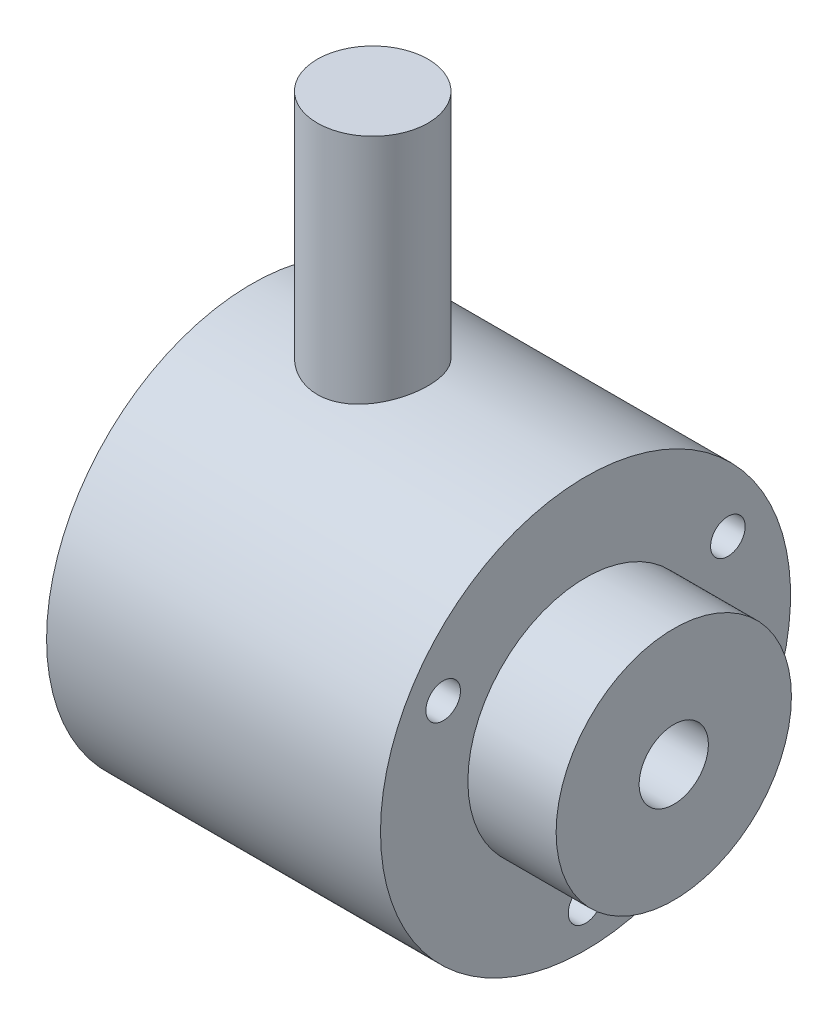
ISO-10303-21;
HEADER;
FILE_DESCRIPTION(('STEP AP214'),'2;1');
FILE_NAME('part.step','',(''),(''),'','','');
FILE_SCHEMA(('AUTOMOTIVE_DESIGN { 1 0 10303 214 1 1 1 1 }'));
ENDSEC;
DATA;
#1=APPLICATION_CONTEXT('core data for automotive mechanical design processes');
#2=APPLICATION_PROTOCOL_DEFINITION('international standard','automotive_design',2000,#1);
#3=PRODUCT_CONTEXT('',#1,'mechanical');
#4=PRODUCT('Part','Part','',(#3));
#5=PRODUCT_RELATED_PRODUCT_CATEGORY('part','',(#4));
#6=PRODUCT_DEFINITION_FORMATION('','',#4);
#7=PRODUCT_DEFINITION_CONTEXT('part definition',#1,'design');
#8=PRODUCT_DEFINITION('design','',#6,#7);
#9=PRODUCT_DEFINITION_SHAPE('','',#8);
#10=(LENGTH_UNIT() NAMED_UNIT(*) SI_UNIT(.MILLI.,.METRE.));
#11=(NAMED_UNIT(*) PLANE_ANGLE_UNIT() SI_UNIT($,.RADIAN.));
#12=(NAMED_UNIT(*) SI_UNIT($,.STERADIAN.) SOLID_ANGLE_UNIT());
#13=UNCERTAINTY_MEASURE_WITH_UNIT(LENGTH_MEASURE(1.E-05),#10,'distance_accuracy_value','');
#14=(GEOMETRIC_REPRESENTATION_CONTEXT(3) GLOBAL_UNCERTAINTY_ASSIGNED_CONTEXT((#13)) GLOBAL_UNIT_ASSIGNED_CONTEXT((#10,
#11,#12)) REPRESENTATION_CONTEXT('',''));
#15=CARTESIAN_POINT('',(0.,0.,0.));
#16=DIRECTION('',(0.,0.,1.));
#17=DIRECTION('',(1.,0.,0.));
#18=AXIS2_PLACEMENT_3D('',#15,#16,#17);
#19=CARTESIAN_POINT('',(0.,0.,0.));
#20=DIRECTION('',(-1.,0.,0.));
#21=DIRECTION('',(0.,0.,1.));
#22=AXIS2_PLACEMENT_3D('',#19,#20,#21);
#23=CYLINDRICAL_SURFACE('',#22,11.85);
#24=CARTESIAN_POINT('',(0.,0.,0.));
#25=DIRECTION('',(-1.,0.,0.));
#26=DIRECTION('',(0.,0.,1.));
#27=AXIS2_PLACEMENT_3D('',#24,#25,#26);
#28=CIRCLE('',#27,11.85);
#29=CARTESIAN_POINT('',(0.,0.,11.85));
#30=VERTEX_POINT('',#29);
#31=EDGE_CURVE('E54',#30,#30,#28,.T.);
#32=ORIENTED_EDGE('',*,*,#31,.F.);
#33=EDGE_LOOP('',(#32));
#34=FACE_BOUND('',#33,.T.);
#35=CARTESIAN_POINT('',(19.3,0.,0.));
#36=DIRECTION('',(-1.,0.,0.));
#37=DIRECTION('',(0.,0.,1.));
#38=AXIS2_PLACEMENT_3D('',#35,#36,#37);
#39=CIRCLE('',#38,11.85);
#40=CARTESIAN_POINT('',(19.3,0.,11.85));
#41=VERTEX_POINT('',#40);
#42=EDGE_CURVE('E49',#41,#41,#39,.T.);
#43=ORIENTED_EDGE('',*,*,#42,.T.);
#44=EDGE_LOOP('',(#43));
#45=FACE_BOUND('',#44,.T.);
#46=CARTESIAN_POINT('',(7.,11.409754598588,-3.2));
#47=CARTESIAN_POINT('',(6.82380774229045,11.4097575680034,-3.19999592401129));
#48=CARTESIAN_POINT('',(6.64757271287549,11.4138804270188,-3.18539868863309));
#49=CARTESIAN_POINT('',(6.30019838440241,11.4298755165217,-3.12750986156378));
#50=CARTESIAN_POINT('',(6.12906159932202,11.4417515060929,-3.08420435058802));
#51=CARTESIAN_POINT('',(5.79695939713014,11.471811921207,-2.97043115845945));
#52=CARTESIAN_POINT('',(5.6359798117785,11.4899873189946,-2.90000233207576));
#53=CARTESIAN_POINT('',(5.32809447371995,11.5305870644057,-2.73410407961744));
#54=CARTESIAN_POINT('',(5.18118991747341,11.553011772764,-2.6386325273374));
#55=CARTESIAN_POINT('',(4.90185693204531,11.6002279726611,-2.42274023706277));
#56=CARTESIAN_POINT('',(4.7698429474427,11.6250622743117,-2.30179251904075));
#57=CARTESIAN_POINT('',(4.52770486938859,11.6739303333733,-2.03951413517226));
#58=CARTESIAN_POINT('',(4.41758309435205,11.6979640057724,-1.89818131324726));
#59=CARTESIAN_POINT('',(4.22062031965671,11.7430014030105,-1.59626366210396));
#60=CARTESIAN_POINT('',(4.13419236113306,11.7639487428485,-1.4354002341465));
#61=CARTESIAN_POINT('',(3.98976602327142,11.799961482024,-1.10076516604323));
#62=CARTESIAN_POINT('',(3.93176272315162,11.8150278993552,-0.92699576613845));
#63=CARTESIAN_POINT('',(3.84717643084845,11.8372784899246,-0.575808395145115));
#64=CARTESIAN_POINT('',(3.81988819948586,11.8446392990129,-0.398571674602367));
#65=CARTESIAN_POINT('',(3.79528677210897,11.8512673231678,-0.0418932622875973));
#66=CARTESIAN_POINT('',(3.79796843625129,11.8505359260496,0.137548046124414));
#67=CARTESIAN_POINT('',(3.83273627728727,11.8411909294001,0.488629489641201));
#68=CARTESIAN_POINT('',(3.86406034273173,11.8327816305976,0.660351367713395));
#69=CARTESIAN_POINT('',(3.9539912779912,11.8092674719823,0.996004341884338));
#70=CARTESIAN_POINT('',(4.01259972310905,11.7941622255717,1.15993498754273));
#71=CARTESIAN_POINT('',(4.15601315484096,11.7586523764224,1.47728465005468));
#72=CARTESIAN_POINT('',(4.24107716741304,11.7381957073039,1.63058054498369));
#73=CARTESIAN_POINT('',(4.4347877291809,11.6941839117502,1.92098043659776));
#74=CARTESIAN_POINT('',(4.54343897597417,11.6706281684767,2.05808119947439));
#75=CARTESIAN_POINT('',(4.78527675183331,11.6220935512996,2.31674828240857));
#76=CARTESIAN_POINT('',(4.9191276338429,11.5970932195982,2.43769018428542));
#77=CARTESIAN_POINT('',(5.20546913518976,11.5491537810121,2.65556513991868));
#78=CARTESIAN_POINT('',(5.3579609507412,11.5262148065715,2.75249665168634));
#79=CARTESIAN_POINT('',(5.67863713907115,11.4849075132602,2.92009097160132));
#80=CARTESIAN_POINT('',(5.84691656566427,11.4665696935773,2.99057995132467));
#81=CARTESIAN_POINT('',(6.19355733166552,11.4369178687564,3.10205966238327));
#82=CARTESIAN_POINT('',(6.37191608482666,11.425602070691,3.14305792398657));
#83=CARTESIAN_POINT('',(6.72780273686184,11.411658614057,3.19330733896917));
#84=CARTESIAN_POINT('',(6.90518901880268,11.408775667861,3.20349166060649));
#85=CARTESIAN_POINT('',(7.25913077717547,11.411325142468,3.19439853899469));
#86=CARTESIAN_POINT('',(7.4356863424694,11.4167566526082,3.17512432227043));
#87=CARTESIAN_POINT('',(7.77933151479855,11.4350760579743,3.10848478303929));
#88=CARTESIAN_POINT('',(7.94653941442026,11.4478139280258,3.06168419628569));
#89=CARTESIAN_POINT('',(8.27073121655569,11.4791633930181,2.9419572780013));
#90=CARTESIAN_POINT('',(8.42771375565732,11.4977757693178,2.86902747088893));
#91=CARTESIAN_POINT('',(8.73089240857395,11.5392982716577,2.69722999475763));
#92=CARTESIAN_POINT('',(8.87676697287682,11.562295554802,2.59781642857554));
#93=CARTESIAN_POINT('',(9.15010593726874,11.609793376176,2.37654730660019));
#94=CARTESIAN_POINT('',(9.27756677667512,11.6342942038462,2.2546874206737));
#95=CARTESIAN_POINT('',(9.51435369753933,11.6829202250697,1.98766156974679));
#96=CARTESIAN_POINT('',(9.62302795520987,11.7070125941024,1.84191041226666));
#97=CARTESIAN_POINT('',(9.81436959196133,11.7513610088361,1.53369440981604));
#98=CARTESIAN_POINT('',(9.89703835570024,11.7716172587678,1.37123045532696));
#99=CARTESIAN_POINT('',(10.0332567737972,11.8058804960917,1.03534423344111));
#100=CARTESIAN_POINT('',(10.0870248347323,11.8199342079645,0.862015538298308));
#101=CARTESIAN_POINT('',(10.164543800741,11.8404146993941,0.508345583337205));
#102=CARTESIAN_POINT('',(10.18830154049,11.8468432155245,0.328005929870998));
#103=CARTESIAN_POINT('',(10.2046882508709,11.8512646812601,-0.0284838875317339));
#104=CARTESIAN_POINT('',(10.1982722253888,11.8495164362624,-0.204587556452675));
#105=CARTESIAN_POINT('',(10.1567172698764,11.8383684732355,-0.553111932300254));
#106=CARTESIAN_POINT('',(10.1215794676829,11.82896905565,-0.725532783569712));
#107=CARTESIAN_POINT('',(10.0241238347795,11.8036285308137,-1.06061737179052));
#108=CARTESIAN_POINT('',(9.96200413452976,11.7877351587624,-1.22334258256347));
#109=CARTESIAN_POINT('',(9.81252467956184,11.751066489492,-1.53615320081743));
#110=CARTESIAN_POINT('',(9.72516131635676,11.7302904943997,-1.68623679726302));
#111=CARTESIAN_POINT('',(9.52490396376074,11.6853704991508,-1.97393214636261));
#112=CARTESIAN_POINT('',(9.41137997102649,11.6611502380674,-2.11109342317194));
#113=CARTESIAN_POINT('',(9.16321284847764,11.6123733344245,-2.36474175477149));
#114=CARTESIAN_POINT('',(9.02856412246683,11.587816604308,-2.48122331377616));
#115=CARTESIAN_POINT('',(8.73829103098257,11.5405034566917,-2.69282910032353));
#116=CARTESIAN_POINT('',(8.58225970993745,11.5178005977344,-2.78740815092461));
#117=CARTESIAN_POINT('',(8.25591651396196,11.4775303232658,-2.94885855927283));
#118=CARTESIAN_POINT('',(8.0856138363468,11.4599596325385,-3.0157475994878));
#119=CARTESIAN_POINT('',(7.76334508913284,11.4343169514178,-3.11141954576664));
#120=CARTESIAN_POINT('',(7.61274290482724,11.4251817322584,-3.14455799961762));
#121=CARTESIAN_POINT('',(7.30810443709434,11.4128996193869,-3.18884868038529));
#122=CARTESIAN_POINT('',(7.15406857092972,11.409752002029,-3.20000356418474));
#123=CARTESIAN_POINT('',(7.,11.409754598588,-3.2));
#124=B_SPLINE_CURVE_WITH_KNOTS('',3,(#46,#47,#48,#49,#50,#51,#52,#53,#54,#55,#56,#57,#58,#59,
#60,#61,#62,#63,#64,#65,#66,#67,#68,#69,#70,#71,#72,#73,#74,#75,#76,#77,#78,#79,#80,#81,#82,#83,
#84,#85,#86,#87,#88,#89,#90,#91,#92,#93,#94,#95,#96,#97,#98,#99,#100,#101,#102,#103,#104,#105,
#106,#107,#108,#109,#110,#111,#112,#113,#114,#115,#116,#117,#118,#119,#120,#121,#122,#123),
.UNSPECIFIED.,.T.,.F.,(4,2,2,2,2,2,2,2,2,2,2,2,2,2,2,2,2,2,2,2,2,2,2,2,2,2,2,2,2,2,2,2,2,2,2,2,
2,2,4),(0.,0.528010074198887,1.05627634292522,1.58378865627004,2.1113457715579,2.6511305284997,
3.19097241896999,3.73970018929446,4.28833293211483,4.82409394550201,5.35976307717268,
5.8815813025168,6.40342965952268,6.93055743822454,7.45779029535627,8.00161015244497,
8.54546492553488,9.09283472939428,9.64006471617913,10.1705476708594,10.7009725271451,
11.2208770374876,11.7408507286849,12.2725058361726,12.8042636131897,13.3518309263622,
13.8993690794717,14.442709063442,14.9859252825824,15.5120664629658,16.0381869840109,
16.5605077942108,17.0829033051786,17.6195131338783,18.156265357767,18.7052087809869,
19.2538011135512,19.7155670966802,20.1772772684314),.UNSPECIFIED.);
#125=CARTESIAN_POINT('',(7.,11.409754598588,-3.2));
#126=VERTEX_POINT('',#125);
#127=EDGE_CURVE('E10',#126,#126,#124,.T.);
#128=ORIENTED_EDGE('',*,*,#127,.F.);
#129=EDGE_LOOP('',(#128));
#130=FACE_BOUND('',#129,.T.);
#131=ADVANCED_FACE('F30',(#34,#45,#130),#23,.T.);
#132=CARTESIAN_POINT('',(0.,11.85,0.));
#133=DIRECTION('',(1.,0.,0.));
#134=DIRECTION('',(0.,0.,-1.));
#135=AXIS2_PLACEMENT_3D('',#132,#133,#134);
#136=PLANE('',#135);
#137=ORIENTED_EDGE('',*,*,#31,.T.);
#138=EDGE_LOOP('',(#137));
#139=FACE_BOUND('',#138,.T.);
#140=ADVANCED_FACE('F32',(#139),#136,.F.);
#141=CARTESIAN_POINT('',(24.4,0.,0.));
#142=DIRECTION('',(-1.,0.,0.));
#143=DIRECTION('',(0.,0.,1.));
#144=AXIS2_PLACEMENT_3D('',#141,#142,#143);
#145=PLANE('',#144);
#146=CARTESIAN_POINT('',(24.4,0.,0.));
#147=DIRECTION('',(1.,0.,0.));
#148=DIRECTION('',(0.,0.,-1.));
#149=AXIS2_PLACEMENT_3D('',#146,#147,#148);
#150=CIRCLE('',#149,2.);
#151=CARTESIAN_POINT('',(24.4,0.,-2.));
#152=VERTEX_POINT('',#151);
#153=EDGE_CURVE('E61',#152,#152,#150,.T.);
#154=ORIENTED_EDGE('',*,*,#153,.F.);
#155=EDGE_LOOP('',(#154));
#156=FACE_BOUND('',#155,.T.);
#157=CARTESIAN_POINT('',(24.4,0.,0.));
#158=DIRECTION('',(-1.,0.,0.));
#159=DIRECTION('',(0.,0.,1.));
#160=AXIS2_PLACEMENT_3D('',#157,#158,#159);
#161=CIRCLE('',#160,6.8);
#162=CARTESIAN_POINT('',(24.4,0.,6.8));
#163=VERTEX_POINT('',#162);
#164=EDGE_CURVE('E41',#163,#163,#161,.T.);
#165=ORIENTED_EDGE('',*,*,#164,.F.);
#166=EDGE_LOOP('',(#165));
#167=FACE_BOUND('',#166,.T.);
#168=ADVANCED_FACE('F109',(#156,#167),#145,.F.);
#169=CARTESIAN_POINT('',(0.,0.,0.));
#170=DIRECTION('',(-1.,0.,0.));
#171=DIRECTION('',(0.,0.,1.));
#172=AXIS2_PLACEMENT_3D('',#169,#170,#171);
#173=CYLINDRICAL_SURFACE('',#172,6.8);
#174=CARTESIAN_POINT('',(19.3,0.,0.));
#175=DIRECTION('',(-1.,0.,0.));
#176=DIRECTION('',(0.,0.,1.));
#177=AXIS2_PLACEMENT_3D('',#174,#175,#176);
#178=CIRCLE('',#177,6.8);
#179=CARTESIAN_POINT('',(19.3,0.,6.8));
#180=VERTEX_POINT('',#179);
#181=EDGE_CURVE('E45',#180,#180,#178,.T.);
#182=ORIENTED_EDGE('',*,*,#181,.F.);
#183=EDGE_LOOP('',(#182));
#184=FACE_BOUND('',#183,.T.);
#185=ORIENTED_EDGE('',*,*,#164,.T.);
#186=EDGE_LOOP('',(#185));
#187=FACE_BOUND('',#186,.T.);
#188=ADVANCED_FACE('F98',(#184,#187),#173,.T.);
#189=CARTESIAN_POINT('',(19.3,6.8,0.));
#190=DIRECTION('',(-1.,0.,0.));
#191=DIRECTION('',(0.,0.,1.));
#192=AXIS2_PLACEMENT_3D('',#189,#190,#191);
#193=PLANE('',#192);
#194=CARTESIAN_POINT('',(19.3,4.75000000000003,-8.22724133595227));
#195=DIRECTION('',(1.,0.,0.));
#196=DIRECTION('',(0.,0.,-1.));
#197=AXIS2_PLACEMENT_3D('',#194,#195,#196);
#198=CIRCLE('',#197,1.);
#199=CARTESIAN_POINT('',(19.3,4.75000000000003,-9.22724133595227));
#200=VERTEX_POINT('',#199);
#201=EDGE_CURVE('E79',#200,#200,#198,.T.);
#202=ORIENTED_EDGE('',*,*,#201,.F.);
#203=EDGE_LOOP('',(#202));
#204=FACE_BOUND('',#203,.T.);
#205=CARTESIAN_POINT('',(19.3,4.75000000000003,8.22724133595215));
#206=DIRECTION('',(1.,0.,0.));
#207=DIRECTION('',(0.,0.,-1.));
#208=AXIS2_PLACEMENT_3D('',#205,#206,#207);
#209=CIRCLE('',#208,1.);
#210=CARTESIAN_POINT('',(19.3,4.75000000000003,7.22724133595215));
#211=VERTEX_POINT('',#210);
#212=EDGE_CURVE('E73',#211,#211,#209,.T.);
#213=ORIENTED_EDGE('',*,*,#212,.F.);
#214=EDGE_LOOP('',(#213));
#215=FACE_BOUND('',#214,.T.);
#216=CARTESIAN_POINT('',(19.3,-9.5,0.));
#217=DIRECTION('',(1.,0.,0.));
#218=DIRECTION('',(0.,0.,-1.));
#219=AXIS2_PLACEMENT_3D('',#216,#217,#218);
#220=CIRCLE('',#219,1.);
#221=CARTESIAN_POINT('',(19.3,-9.5,-1.));
#222=VERTEX_POINT('',#221);
#223=EDGE_CURVE('E67',#222,#222,#220,.T.);
#224=ORIENTED_EDGE('',*,*,#223,.F.);
#225=EDGE_LOOP('',(#224));
#226=FACE_BOUND('',#225,.T.);
#227=ORIENTED_EDGE('',*,*,#42,.F.);
#228=EDGE_LOOP('',(#227));
#229=FACE_BOUND('',#228,.T.);
#230=ORIENTED_EDGE('',*,*,#181,.T.);
#231=EDGE_LOOP('',(#230));
#232=FACE_BOUND('',#231,.T.);
#233=ADVANCED_FACE('F94',(#204,#215,#226,#229,#232),#193,.F.);
#234=CARTESIAN_POINT('',(7.,25.,0.));
#235=DIRECTION('',(0.,-1.,0.));
#236=DIRECTION('',(0.,0.,-1.));
#237=AXIS2_PLACEMENT_3D('',#234,#235,#236);
#238=CYLINDRICAL_SURFACE('',#237,3.2);
#239=CARTESIAN_POINT('',(7.,25.,0.));
#240=DIRECTION('',(0.,1.,0.));
#241=DIRECTION('',(0.,0.,1.));
#242=AXIS2_PLACEMENT_3D('',#239,#240,#241);
#243=CIRCLE('',#242,3.2);
#244=CARTESIAN_POINT('',(7.,25.,3.2));
#245=VERTEX_POINT('',#244);
#246=EDGE_CURVE('E57',#245,#245,#243,.T.);
#247=ORIENTED_EDGE('',*,*,#246,.F.);
#248=EDGE_LOOP('',(#247));
#249=FACE_BOUND('',#248,.T.);
#250=ORIENTED_EDGE('',*,*,#127,.T.);
#251=EDGE_LOOP('',(#250));
#252=FACE_BOUND('',#251,.T.);
#253=ADVANCED_FACE('F97',(#249,#252),#238,.T.);
#254=CARTESIAN_POINT('',(7.,25.,0.));
#255=DIRECTION('',(0.,1.,0.));
#256=DIRECTION('',(0.,0.,1.));
#257=AXIS2_PLACEMENT_3D('',#254,#255,#256);
#258=PLANE('',#257);
#259=ORIENTED_EDGE('',*,*,#246,.T.);
#260=EDGE_LOOP('',(#259));
#261=FACE_BOUND('',#260,.T.);
#262=ADVANCED_FACE('F127',(#261),#258,.T.);
#263=CARTESIAN_POINT('',(10.4,0.,0.));
#264=DIRECTION('',(1.,0.,0.));
#265=DIRECTION('',(0.,0.,-1.));
#266=AXIS2_PLACEMENT_3D('',#263,#264,#265);
#267=CYLINDRICAL_SURFACE('',#266,2.);
#268=CARTESIAN_POINT('',(10.4,0.,0.));
#269=DIRECTION('',(1.,0.,0.));
#270=DIRECTION('',(0.,0.,-1.));
#271=AXIS2_PLACEMENT_3D('',#268,#269,#270);
#272=CIRCLE('',#271,2.);
#273=CARTESIAN_POINT('',(10.4,0.,-2.));
#274=VERTEX_POINT('',#273);
#275=EDGE_CURVE('E60',#274,#274,#272,.T.);
#276=ORIENTED_EDGE('',*,*,#275,.F.);
#277=EDGE_LOOP('',(#276));
#278=FACE_BOUND('',#277,.T.);
#279=ORIENTED_EDGE('',*,*,#153,.T.);
#280=EDGE_LOOP('',(#279));
#281=FACE_BOUND('',#280,.T.);
#282=ADVANCED_FACE('F131',(#278,#281),#267,.F.);
#283=CARTESIAN_POINT('',(10.4,0.,0.));
#284=DIRECTION('',(1.,0.,0.));
#285=DIRECTION('',(0.,0.,-1.));
#286=AXIS2_PLACEMENT_3D('',#283,#284,#285);
#287=PLANE('',#286);
#288=ORIENTED_EDGE('',*,*,#275,.T.);
#289=EDGE_LOOP('',(#288));
#290=FACE_BOUND('',#289,.T.);
#291=ADVANCED_FACE('F135',(#290),#287,.T.);
#292=CARTESIAN_POINT('',(15.3,-9.5,0.));
#293=DIRECTION('',(1.,0.,0.));
#294=DIRECTION('',(0.,0.,-1.));
#295=AXIS2_PLACEMENT_3D('',#292,#293,#294);
#296=CYLINDRICAL_SURFACE('',#295,1.);
#297=CARTESIAN_POINT('',(15.3,-9.5,0.));
#298=DIRECTION('',(1.,0.,0.));
#299=DIRECTION('',(0.,0.,-1.));
#300=AXIS2_PLACEMENT_3D('',#297,#298,#299);
#301=CIRCLE('',#300,1.);
#302=CARTESIAN_POINT('',(15.3,-9.5,-1.));
#303=VERTEX_POINT('',#302);
#304=EDGE_CURVE('E64',#303,#303,#301,.T.);
#305=ORIENTED_EDGE('',*,*,#304,.F.);
#306=EDGE_LOOP('',(#305));
#307=FACE_BOUND('',#306,.T.);
#308=ORIENTED_EDGE('',*,*,#223,.T.);
#309=EDGE_LOOP('',(#308));
#310=FACE_BOUND('',#309,.T.);
#311=ADVANCED_FACE('F139',(#307,#310),#296,.F.);
#312=CARTESIAN_POINT('',(15.3,-9.5,0.));
#313=DIRECTION('',(1.,0.,0.));
#314=DIRECTION('',(0.,0.,-1.));
#315=AXIS2_PLACEMENT_3D('',#312,#313,#314);
#316=PLANE('',#315);
#317=ORIENTED_EDGE('',*,*,#304,.T.);
#318=EDGE_LOOP('',(#317));
#319=FACE_BOUND('',#318,.T.);
#320=ADVANCED_FACE('F143',(#319),#316,.T.);
#321=CARTESIAN_POINT('',(15.3,4.75000000000003,8.22724133595215));
#322=DIRECTION('',(1.,0.,0.));
#323=DIRECTION('',(0.,0.,-1.));
#324=AXIS2_PLACEMENT_3D('',#321,#322,#323);
#325=CYLINDRICAL_SURFACE('',#324,1.);
#326=CARTESIAN_POINT('',(15.3,4.75000000000003,8.22724133595215));
#327=DIRECTION('',(1.,0.,0.));
#328=DIRECTION('',(0.,0.,-1.));
#329=AXIS2_PLACEMENT_3D('',#326,#327,#328);
#330=CIRCLE('',#329,1.);
#331=CARTESIAN_POINT('',(15.3,4.75000000000003,7.22724133595215));
#332=VERTEX_POINT('',#331);
#333=EDGE_CURVE('E70',#332,#332,#330,.T.);
#334=ORIENTED_EDGE('',*,*,#333,.F.);
#335=EDGE_LOOP('',(#334));
#336=FACE_BOUND('',#335,.T.);
#337=ORIENTED_EDGE('',*,*,#212,.T.);
#338=EDGE_LOOP('',(#337));
#339=FACE_BOUND('',#338,.T.);
#340=ADVANCED_FACE('F147',(#336,#339),#325,.F.);
#341=CARTESIAN_POINT('',(15.3,4.75000000000003,8.22724133595215));
#342=DIRECTION('',(1.,0.,0.));
#343=DIRECTION('',(0.,0.,-1.));
#344=AXIS2_PLACEMENT_3D('',#341,#342,#343);
#345=PLANE('',#344);
#346=ORIENTED_EDGE('',*,*,#333,.T.);
#347=EDGE_LOOP('',(#346));
#348=FACE_BOUND('',#347,.T.);
#349=ADVANCED_FACE('F90',(#348),#345,.T.);
#350=CARTESIAN_POINT('',(15.3,4.75000000000003,-8.22724133595227));
#351=DIRECTION('',(1.,0.,0.));
#352=DIRECTION('',(0.,0.,-1.));
#353=AXIS2_PLACEMENT_3D('',#350,#351,#352);
#354=CYLINDRICAL_SURFACE('',#353,1.);
#355=CARTESIAN_POINT('',(15.3,4.75000000000003,-8.22724133595227));
#356=DIRECTION('',(1.,0.,0.));
#357=DIRECTION('',(0.,0.,-1.));
#358=AXIS2_PLACEMENT_3D('',#355,#356,#357);
#359=CIRCLE('',#358,1.);
#360=CARTESIAN_POINT('',(15.3,4.75000000000003,-9.22724133595227));
#361=VERTEX_POINT('',#360);
#362=EDGE_CURVE('E76',#361,#361,#359,.T.);
#363=ORIENTED_EDGE('',*,*,#362,.F.);
#364=EDGE_LOOP('',(#363));
#365=FACE_BOUND('',#364,.T.);
#366=ORIENTED_EDGE('',*,*,#201,.T.);
#367=EDGE_LOOP('',(#366));
#368=FACE_BOUND('',#367,.T.);
#369=ADVANCED_FACE('F87',(#365,#368),#354,.F.);
#370=CARTESIAN_POINT('',(15.3,4.75000000000003,-8.22724133595227));
#371=DIRECTION('',(1.,0.,0.));
#372=DIRECTION('',(0.,0.,-1.));
#373=AXIS2_PLACEMENT_3D('',#370,#371,#372);
#374=PLANE('',#373);
#375=ORIENTED_EDGE('',*,*,#362,.T.);
#376=EDGE_LOOP('',(#375));
#377=FACE_BOUND('',#376,.T.);
#378=ADVANCED_FACE('F85',(#377),#374,.T.);
#379=CLOSED_SHELL('',(#131,#140,#168,#188,#233,#253,#262,#282,#291,#311,#320,#340,#349,#369,#378));
#380=MANIFOLD_SOLID_BREP('B2',#379);
#381=ADVANCED_BREP_SHAPE_REPRESENTATION('',(#18,#380),#14);
#382=SHAPE_DEFINITION_REPRESENTATION(#9,#381);
ENDSEC;
END-ISO-10303-21;
